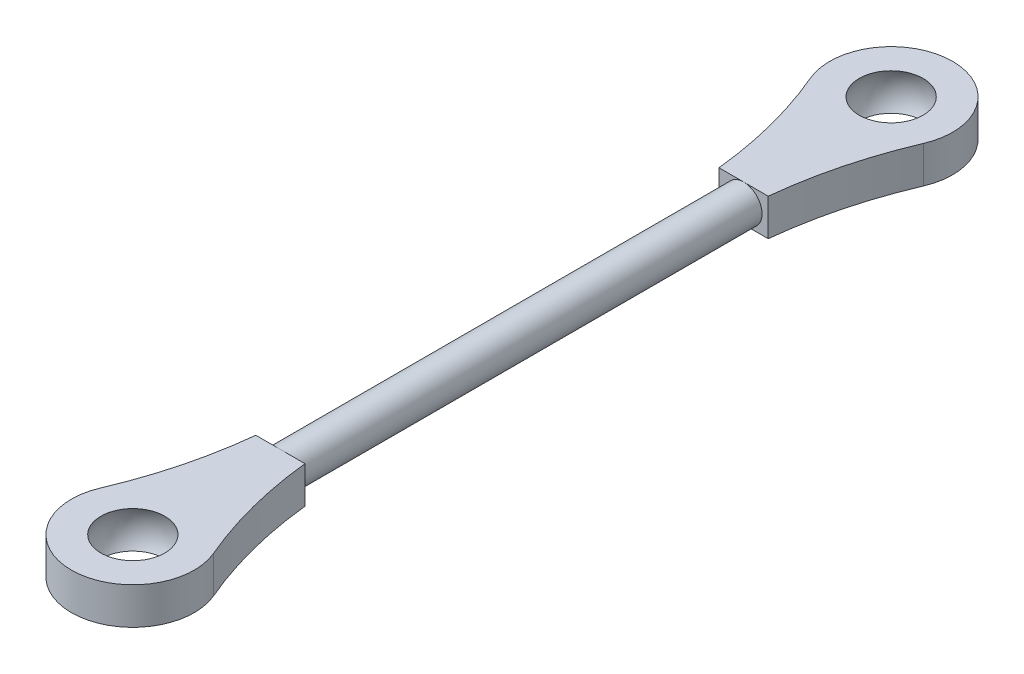
ISO-10303-21;
HEADER;
FILE_DESCRIPTION(('STEP AP214'),'2;1');
FILE_NAME('part.step','',(''),(''),'','','');
FILE_SCHEMA(('AUTOMOTIVE_DESIGN { 1 0 10303 214 1 1 1 1 }'));
ENDSEC;
DATA;
#1=APPLICATION_CONTEXT('core data for automotive mechanical design processes');
#2=APPLICATION_PROTOCOL_DEFINITION('international standard','automotive_design',2000,#1);
#3=PRODUCT_CONTEXT('',#1,'mechanical');
#4=PRODUCT('Part','Part','',(#3));
#5=PRODUCT_RELATED_PRODUCT_CATEGORY('part','',(#4));
#6=PRODUCT_DEFINITION_FORMATION('','',#4);
#7=PRODUCT_DEFINITION_CONTEXT('part definition',#1,'design');
#8=PRODUCT_DEFINITION('design','',#6,#7);
#9=PRODUCT_DEFINITION_SHAPE('','',#8);
#10=(LENGTH_UNIT() NAMED_UNIT(*) SI_UNIT(.MILLI.,.METRE.));
#11=(NAMED_UNIT(*) PLANE_ANGLE_UNIT() SI_UNIT($,.RADIAN.));
#12=(NAMED_UNIT(*) SI_UNIT($,.STERADIAN.) SOLID_ANGLE_UNIT());
#13=UNCERTAINTY_MEASURE_WITH_UNIT(LENGTH_MEASURE(1.E-05),#10,'distance_accuracy_value','');
#14=(GEOMETRIC_REPRESENTATION_CONTEXT(3) GLOBAL_UNCERTAINTY_ASSIGNED_CONTEXT((#13)) GLOBAL_UNIT_ASSIGNED_CONTEXT((#10,
#11,#12)) REPRESENTATION_CONTEXT('',''));
#15=CARTESIAN_POINT('',(0.,0.,0.));
#16=DIRECTION('',(0.,0.,1.));
#17=DIRECTION('',(1.,0.,0.));
#18=AXIS2_PLACEMENT_3D('',#15,#16,#17);
#19=CARTESIAN_POINT('',(0.,-30.,264.));
#20=DIRECTION('',(0.,0.,-1.));
#21=DIRECTION('',(1.,0.,0.));
#22=AXIS2_PLACEMENT_3D('',#19,#20,#21);
#23=SPHERICAL_SURFACE('',#22,3.);
#24=CARTESIAN_POINT('',(0.,-30.,264.));
#25=DIRECTION('',(0.,-1.,0.));
#26=DIRECTION('',(0.,0.,-1.));
#27=AXIS2_PLACEMENT_3D('',#24,#25,#26);
#28=SPHERICAL_SURFACE('',#27,3.);
#29=CARTESIAN_POINT('',(0.,-28.5,264.));
#30=DIRECTION('',(0.,-1.,0.));
#31=DIRECTION('',(0.,0.,-1.));
#32=AXIS2_PLACEMENT_3D('',#29,#30,#31);
#33=CIRCLE('',#32,2.5980762113533);
#34=CARTESIAN_POINT('',(0.,-28.5,261.401923788647));
#35=VERTEX_POINT('',#34);
#36=EDGE_CURVE('E188',#35,#35,#33,.T.);
#37=ORIENTED_EDGE('',*,*,#36,.F.);
#38=EDGE_LOOP('',(#37));
#39=FACE_BOUND('',#38,.T.);
#40=CARTESIAN_POINT('',(0.,-31.5,264.));
#41=DIRECTION('',(0.,-1.,0.));
#42=DIRECTION('',(0.,0.,-1.));
#43=AXIS2_PLACEMENT_3D('',#40,#41,#42);
#44=CIRCLE('',#43,2.59807621135333);
#45=CARTESIAN_POINT('',(0.,-31.5,261.401923788647));
#46=VERTEX_POINT('',#45);
#47=EDGE_CURVE('E45',#46,#46,#44,.T.);
#48=ORIENTED_EDGE('',*,*,#47,.T.);
#49=EDGE_LOOP('',(#48));
#50=FACE_BOUND('',#49,.T.);
#51=ADVANCED_FACE('F41',(#39,#50),#28,.F.);
#52=CARTESIAN_POINT('',(0.,-30.,202.320508075689));
#53=DIRECTION('',(-1.,0.,0.));
#54=DIRECTION('',(0.,0.,1.));
#55=AXIS2_PLACEMENT_3D('',#52,#53,#54);
#56=SPHERICAL_SURFACE('',#55,3.);
#57=CARTESIAN_POINT('',(0.,-30.,202.320508075689));
#58=DIRECTION('',(0.,1.,0.));
#59=DIRECTION('',(0.,0.,1.));
#60=AXIS2_PLACEMENT_3D('',#57,#58,#59);
#61=SPHERICAL_SURFACE('',#60,3.);
#62=CARTESIAN_POINT('',(0.,-31.5,202.320508075689));
#63=DIRECTION('',(0.,1.,0.));
#64=DIRECTION('',(0.,0.,1.));
#65=AXIS2_PLACEMENT_3D('',#62,#63,#64);
#66=CIRCLE('',#65,2.59807621135332);
#67=CARTESIAN_POINT('',(0.,-31.5,204.918584287042));
#68=VERTEX_POINT('',#67);
#69=EDGE_CURVE('E186',#68,#68,#66,.T.);
#70=ORIENTED_EDGE('',*,*,#69,.F.);
#71=EDGE_LOOP('',(#70));
#72=FACE_BOUND('',#71,.T.);
#73=CARTESIAN_POINT('',(0.,-28.5,202.320508075689));
#74=DIRECTION('',(0.,1.,0.));
#75=DIRECTION('',(0.,0.,1.));
#76=AXIS2_PLACEMENT_3D('',#73,#74,#75);
#77=CIRCLE('',#76,2.59807621135332);
#78=CARTESIAN_POINT('',(0.,-28.5,204.918584287042));
#79=VERTEX_POINT('',#78);
#80=EDGE_CURVE('E11',#79,#79,#77,.T.);
#81=ORIENTED_EDGE('',*,*,#80,.T.);
#82=EDGE_LOOP('',(#81));
#83=FACE_BOUND('',#82,.T.);
#84=ADVANCED_FACE('F43',(#72,#83),#61,.F.);
#85=CARTESIAN_POINT('',(0.,-30.,252.));
#86=DIRECTION('',(0.,0.,-1.));
#87=DIRECTION('',(-1.,0.,0.));
#88=AXIS2_PLACEMENT_3D('',#85,#86,#87);
#89=CYLINDRICAL_SURFACE('',#88,1.5);
#90=CARTESIAN_POINT('',(0.,-30.,214.320508075689));
#91=DIRECTION('',(0.,0.,-1.));
#92=DIRECTION('',(-1.,0.,0.));
#93=AXIS2_PLACEMENT_3D('',#90,#91,#92);
#94=CIRCLE('',#93,1.5);
#95=CARTESIAN_POINT('',(0.,-31.5,214.320508075689));
#96=VERTEX_POINT('',#95);
#97=CARTESIAN_POINT('',(0.,-28.5,214.320508075689));
#98=VERTEX_POINT('',#97);
#99=EDGE_CURVE('E56',#96,#98,#94,.T.);
#100=ORIENTED_EDGE('',*,*,#99,.F.);
#101=EDGE_CURVE('E185',#98,#96,#94,.T.);
#102=ORIENTED_EDGE('',*,*,#101,.F.);
#103=EDGE_LOOP('',(#100,#102));
#104=FACE_BOUND('',#103,.T.);
#105=CARTESIAN_POINT('',(0.,-30.,252.));
#106=DIRECTION('',(0.,0.,-1.));
#107=DIRECTION('',(-1.,0.,0.));
#108=AXIS2_PLACEMENT_3D('',#105,#106,#107);
#109=CIRCLE('',#108,1.5);
#110=CARTESIAN_POINT('',(0.,-31.5,252.));
#111=VERTEX_POINT('',#110);
#112=CARTESIAN_POINT('',(0.,-28.5,252.));
#113=VERTEX_POINT('',#112);
#114=EDGE_CURVE('E182',#111,#113,#109,.T.);
#115=ORIENTED_EDGE('',*,*,#114,.T.);
#116=EDGE_CURVE('E181',#113,#111,#109,.T.);
#117=ORIENTED_EDGE('',*,*,#116,.T.);
#118=EDGE_LOOP('',(#115,#117));
#119=FACE_BOUND('',#118,.T.);
#120=ADVANCED_FACE('F196',(#104,#119),#89,.T.);
#121=CARTESIAN_POINT('',(0.,-31.5,202.320508075689));
#122=DIRECTION('',(0.,1.,0.));
#123=DIRECTION('',(0.,0.,1.));
#124=AXIS2_PLACEMENT_3D('',#121,#122,#123);
#125=CYLINDRICAL_SURFACE('',#124,5.);
#126=CARTESIAN_POINT('',(0.,-28.5,202.320508075689));
#127=DIRECTION('',(0.,-1.,0.));
#128=DIRECTION('',(0.,0.,-1.));
#129=AXIS2_PLACEMENT_3D('',#126,#127,#128);
#130=CIRCLE('',#129,5.);
#131=CARTESIAN_POINT('',(-4.60113103157555,-28.5,204.277442727197));
#132=VERTEX_POINT('',#131);
#133=CARTESIAN_POINT('',(4.60113103157555,-28.5,204.277442727197));
#134=VERTEX_POINT('',#133);
#135=EDGE_CURVE('E209',#132,#134,#130,.T.);
#136=ORIENTED_EDGE('',*,*,#135,.T.);
#137=DIRECTION('',(0.,1.,0.));
#138=VECTOR('',#137,1.);
#139=CARTESIAN_POINT('',(4.60113103157555,-31.5,204.277442727197));
#140=LINE('',#139,#138);
#141=CARTESIAN_POINT('',(4.60113103157555,-31.5,204.277442727197));
#142=VERTEX_POINT('',#141);
#143=EDGE_CURVE('E126',#142,#134,#140,.T.);
#144=ORIENTED_EDGE('',*,*,#143,.F.);
#145=CARTESIAN_POINT('',(0.,-31.5,202.320508075689));
#146=DIRECTION('',(0.,-1.,0.));
#147=DIRECTION('',(0.,0.,-1.));
#148=AXIS2_PLACEMENT_3D('',#145,#146,#147);
#149=CIRCLE('',#148,5.);
#150=CARTESIAN_POINT('',(-4.60113103157555,-31.5,204.277442727197));
#151=VERTEX_POINT('',#150);
#152=EDGE_CURVE('E119',#151,#142,#149,.T.);
#153=ORIENTED_EDGE('',*,*,#152,.F.);
#154=DIRECTION('',(0.,1.,0.));
#155=VECTOR('',#154,1.);
#156=CARTESIAN_POINT('',(-4.60113103157555,-31.5,204.277442727197));
#157=LINE('',#156,#155);
#158=EDGE_CURVE('E123',#151,#132,#157,.T.);
#159=ORIENTED_EDGE('',*,*,#158,.T.);
#160=EDGE_LOOP('',(#136,#144,#153,#159));
#161=FACE_BOUND('',#160,.T.);
#162=ADVANCED_FACE('F121',(#161),#125,.T.);
#163=CARTESIAN_POINT('',(36.8187330461745,-31.5,217.980104385426));
#164=DIRECTION('',(0.,1.,0.));
#165=DIRECTION('',(0.,0.,1.));
#166=AXIS2_PLACEMENT_3D('',#163,#164,#165);
#167=CYLINDRICAL_SURFACE('',#166,35.0105243618402);
#168=CARTESIAN_POINT('',(36.8187330461745,-28.5,217.980104385426));
#169=DIRECTION('',(0.,1.,0.));
#170=DIRECTION('',(0.,0.,-1.));
#171=AXIS2_PLACEMENT_3D('',#168,#169,#170);
#172=CIRCLE('',#171,35.0105243618402);
#173=CARTESIAN_POINT('',(2.,-28.5,214.320508075689));
#174=VERTEX_POINT('',#173);
#175=EDGE_CURVE('E211',#134,#174,#172,.T.);
#176=ORIENTED_EDGE('',*,*,#175,.T.);
#177=DIRECTION('',(0.,1.,0.));
#178=VECTOR('',#177,1.);
#179=CARTESIAN_POINT('',(2.,-31.5,214.320508075689));
#180=LINE('',#179,#178);
#181=CARTESIAN_POINT('',(2.,-31.5,214.320508075689));
#182=VERTEX_POINT('',#181);
#183=EDGE_CURVE('E150',#182,#174,#180,.T.);
#184=ORIENTED_EDGE('',*,*,#183,.F.);
#185=CARTESIAN_POINT('',(36.8187330461745,-31.5,217.980104385426));
#186=DIRECTION('',(0.,1.,0.));
#187=DIRECTION('',(0.,0.,-1.));
#188=AXIS2_PLACEMENT_3D('',#185,#186,#187);
#189=CIRCLE('',#188,35.0105243618402);
#190=EDGE_CURVE('E129',#142,#182,#189,.T.);
#191=ORIENTED_EDGE('',*,*,#190,.F.);
#192=ORIENTED_EDGE('',*,*,#143,.T.);
#193=EDGE_LOOP('',(#176,#184,#191,#192));
#194=FACE_BOUND('',#193,.T.);
#195=ADVANCED_FACE('F226',(#194),#167,.F.);
#196=CARTESIAN_POINT('',(2.,-31.5,214.320508075689));
#197=DIRECTION('',(0.,0.,-1.));
#198=DIRECTION('',(-1.,0.,0.));
#199=AXIS2_PLACEMENT_3D('',#196,#197,#198);
#200=PLANE('',#199);
#201=DIRECTION('',(-1.,0.,0.));
#202=VECTOR('',#201,1.);
#203=CARTESIAN_POINT('',(2.,-28.5,214.320508075689));
#204=LINE('',#203,#202);
#205=EDGE_CURVE('E140',#174,#98,#204,.T.);
#206=ORIENTED_EDGE('',*,*,#205,.T.);
#207=ORIENTED_EDGE('',*,*,#101,.T.);
#208=DIRECTION('',(-1.,0.,0.));
#209=VECTOR('',#208,1.);
#210=CARTESIAN_POINT('',(2.,-31.5,214.320508075689));
#211=LINE('',#210,#209);
#212=EDGE_CURVE('E214',#182,#96,#211,.T.);
#213=ORIENTED_EDGE('',*,*,#212,.F.);
#214=ORIENTED_EDGE('',*,*,#183,.T.);
#215=EDGE_LOOP('',(#206,#207,#213,#214));
#216=FACE_BOUND('',#215,.T.);
#217=ADVANCED_FACE('F224',(#216),#200,.F.);
#218=CARTESIAN_POINT('',(-2.,-31.5,214.320508075689));
#219=VERTEX_POINT('',#218);
#220=EDGE_CURVE('E136',#96,#219,#211,.T.);
#221=ORIENTED_EDGE('',*,*,#220,.F.);
#222=ORIENTED_EDGE('',*,*,#99,.T.);
#223=CARTESIAN_POINT('',(-2.,-28.5,214.320508075689));
#224=VERTEX_POINT('',#223);
#225=EDGE_CURVE('E206',#98,#224,#204,.T.);
#226=ORIENTED_EDGE('',*,*,#225,.T.);
#227=DIRECTION('',(0.,1.,0.));
#228=VECTOR('',#227,1.);
#229=CARTESIAN_POINT('',(-2.,-31.5,214.320508075689));
#230=LINE('',#229,#228);
#231=EDGE_CURVE('E219',#219,#224,#230,.T.);
#232=ORIENTED_EDGE('',*,*,#231,.F.);
#233=EDGE_LOOP('',(#221,#222,#226,#232));
#234=FACE_BOUND('',#233,.T.);
#235=ADVANCED_FACE('F234',(#234),#200,.F.);
#236=CARTESIAN_POINT('',(-36.8187330461745,-31.5,217.980104385426));
#237=DIRECTION('',(0.,1.,0.));
#238=DIRECTION('',(0.,0.,1.));
#239=AXIS2_PLACEMENT_3D('',#236,#237,#238);
#240=CYLINDRICAL_SURFACE('',#239,35.0105243618402);
#241=CARTESIAN_POINT('',(-36.8187330461745,-28.5,217.980104385426));
#242=DIRECTION('',(0.,1.,0.));
#243=DIRECTION('',(0.,0.,1.));
#244=AXIS2_PLACEMENT_3D('',#241,#242,#243);
#245=CIRCLE('',#244,35.0105243618402);
#246=EDGE_CURVE('E144',#224,#132,#245,.T.);
#247=ORIENTED_EDGE('',*,*,#246,.T.);
#248=ORIENTED_EDGE('',*,*,#158,.F.);
#249=CARTESIAN_POINT('',(-36.8187330461745,-31.5,217.980104385426));
#250=DIRECTION('',(0.,1.,0.));
#251=DIRECTION('',(0.,0.,1.));
#252=AXIS2_PLACEMENT_3D('',#249,#250,#251);
#253=CIRCLE('',#252,35.0105243618402);
#254=EDGE_CURVE('E130',#219,#151,#253,.T.);
#255=ORIENTED_EDGE('',*,*,#254,.F.);
#256=ORIENTED_EDGE('',*,*,#231,.T.);
#257=EDGE_LOOP('',(#247,#248,#255,#256));
#258=FACE_BOUND('',#257,.T.);
#259=ADVANCED_FACE('F142',(#258),#240,.F.);
#260=CARTESIAN_POINT('',(-36.8187330461745,-28.5,217.980104385426));
#261=DIRECTION('',(0.,1.,0.));
#262=DIRECTION('',(0.,0.,1.));
#263=AXIS2_PLACEMENT_3D('',#260,#261,#262);
#264=PLANE('',#263);
#265=ORIENTED_EDGE('',*,*,#80,.F.);
#266=EDGE_LOOP('',(#265));
#267=FACE_BOUND('',#266,.T.);
#268=ORIENTED_EDGE('',*,*,#246,.F.);
#269=ORIENTED_EDGE('',*,*,#225,.F.);
#270=ORIENTED_EDGE('',*,*,#205,.F.);
#271=ORIENTED_EDGE('',*,*,#175,.F.);
#272=ORIENTED_EDGE('',*,*,#135,.F.);
#273=EDGE_LOOP('',(#268,#269,#270,#271,#272));
#274=FACE_BOUND('',#273,.T.);
#275=ADVANCED_FACE('F200',(#267,#274),#264,.T.);
#276=CARTESIAN_POINT('',(-36.8187330461745,-31.5,217.980104385426));
#277=DIRECTION('',(0.,1.,0.));
#278=DIRECTION('',(0.,0.,1.));
#279=AXIS2_PLACEMENT_3D('',#276,#277,#278);
#280=PLANE('',#279);
#281=ORIENTED_EDGE('',*,*,#69,.T.);
#282=EDGE_LOOP('',(#281));
#283=FACE_BOUND('',#282,.T.);
#284=ORIENTED_EDGE('',*,*,#254,.T.);
#285=ORIENTED_EDGE('',*,*,#152,.T.);
#286=ORIENTED_EDGE('',*,*,#190,.T.);
#287=ORIENTED_EDGE('',*,*,#212,.T.);
#288=ORIENTED_EDGE('',*,*,#220,.T.);
#289=EDGE_LOOP('',(#284,#285,#286,#287,#288));
#290=FACE_BOUND('',#289,.T.);
#291=ADVANCED_FACE('F133',(#283,#290),#280,.F.);
#292=CARTESIAN_POINT('',(2.,-31.5,252.));
#293=DIRECTION('',(0.,0.,1.));
#294=DIRECTION('',(1.,0.,0.));
#295=AXIS2_PLACEMENT_3D('',#292,#293,#294);
#296=PLANE('',#295);
#297=ORIENTED_EDGE('',*,*,#114,.F.);
#298=DIRECTION('',(1.,0.,0.));
#299=VECTOR('',#298,1.);
#300=CARTESIAN_POINT('',(2.,-31.5,252.));
#301=LINE('',#300,#299);
#302=CARTESIAN_POINT('',(-2.,-31.5,252.));
#303=VERTEX_POINT('',#302);
#304=EDGE_CURVE('E159',#303,#111,#301,.T.);
#305=ORIENTED_EDGE('',*,*,#304,.F.);
#306=DIRECTION('',(0.,1.,0.));
#307=VECTOR('',#306,1.);
#308=CARTESIAN_POINT('',(-2.,-31.5,252.));
#309=LINE('',#308,#307);
#310=CARTESIAN_POINT('',(-2.,-28.5,252.));
#311=VERTEX_POINT('',#310);
#312=EDGE_CURVE('E179',#303,#311,#309,.T.);
#313=ORIENTED_EDGE('',*,*,#312,.T.);
#314=DIRECTION('',(1.,0.,0.));
#315=VECTOR('',#314,1.);
#316=CARTESIAN_POINT('',(2.,-28.5,252.));
#317=LINE('',#316,#315);
#318=EDGE_CURVE('E64',#311,#113,#317,.T.);
#319=ORIENTED_EDGE('',*,*,#318,.T.);
#320=EDGE_LOOP('',(#297,#305,#313,#319));
#321=FACE_BOUND('',#320,.T.);
#322=ADVANCED_FACE('F253',(#321),#296,.F.);
#323=ORIENTED_EDGE('',*,*,#116,.F.);
#324=CARTESIAN_POINT('',(2.,-28.5,252.));
#325=VERTEX_POINT('',#324);
#326=EDGE_CURVE('E148',#113,#325,#317,.T.);
#327=ORIENTED_EDGE('',*,*,#326,.T.);
#328=DIRECTION('',(0.,1.,0.));
#329=VECTOR('',#328,1.);
#330=CARTESIAN_POINT('',(2.,-31.5,252.));
#331=LINE('',#330,#329);
#332=CARTESIAN_POINT('',(2.,-31.5,252.));
#333=VERTEX_POINT('',#332);
#334=EDGE_CURVE('E176',#333,#325,#331,.T.);
#335=ORIENTED_EDGE('',*,*,#334,.F.);
#336=EDGE_CURVE('E157',#111,#333,#301,.T.);
#337=ORIENTED_EDGE('',*,*,#336,.F.);
#338=EDGE_LOOP('',(#323,#327,#335,#337));
#339=FACE_BOUND('',#338,.T.);
#340=ADVANCED_FACE('F256',(#339),#296,.F.);
#341=CARTESIAN_POINT('',(36.8187330461745,-31.5,248.340403690262));
#342=DIRECTION('',(0.,1.,0.));
#343=DIRECTION('',(0.,0.,1.));
#344=AXIS2_PLACEMENT_3D('',#341,#342,#343);
#345=CYLINDRICAL_SURFACE('',#344,35.0105243618403);
#346=CARTESIAN_POINT('',(36.8187330461745,-28.5,248.340403690262));
#347=DIRECTION('',(0.,1.,0.));
#348=DIRECTION('',(0.,0.,1.));
#349=AXIS2_PLACEMENT_3D('',#346,#347,#348);
#350=CIRCLE('',#349,35.0105243618403);
#351=CARTESIAN_POINT('',(4.60113103157555,-28.5,262.043065348492));
#352=VERTEX_POINT('',#351);
#353=EDGE_CURVE('E168',#325,#352,#350,.T.);
#354=ORIENTED_EDGE('',*,*,#353,.T.);
#355=DIRECTION('',(0.,1.,0.));
#356=VECTOR('',#355,1.);
#357=CARTESIAN_POINT('',(4.60113103157555,-31.5,262.043065348492));
#358=LINE('',#357,#356);
#359=CARTESIAN_POINT('',(4.60113103157555,-31.5,262.043065348492));
#360=VERTEX_POINT('',#359);
#361=EDGE_CURVE('E173',#360,#352,#358,.T.);
#362=ORIENTED_EDGE('',*,*,#361,.F.);
#363=CARTESIAN_POINT('',(36.8187330461745,-31.5,248.340403690262));
#364=DIRECTION('',(0.,1.,0.));
#365=DIRECTION('',(0.,0.,1.));
#366=AXIS2_PLACEMENT_3D('',#363,#364,#365);
#367=CIRCLE('',#366,35.0105243618403);
#368=EDGE_CURVE('E162',#333,#360,#367,.T.);
#369=ORIENTED_EDGE('',*,*,#368,.F.);
#370=ORIENTED_EDGE('',*,*,#334,.T.);
#371=EDGE_LOOP('',(#354,#362,#369,#370));
#372=FACE_BOUND('',#371,.T.);
#373=ADVANCED_FACE('F257',(#372),#345,.F.);
#374=CARTESIAN_POINT('',(0.,-31.5,264.));
#375=DIRECTION('',(0.,1.,0.));
#376=DIRECTION('',(0.,0.,1.));
#377=AXIS2_PLACEMENT_3D('',#374,#375,#376);
#378=CYLINDRICAL_SURFACE('',#377,4.99999999999999);
#379=CARTESIAN_POINT('',(0.,-28.5,264.));
#380=DIRECTION('',(0.,-1.,0.));
#381=DIRECTION('',(0.,0.,1.));
#382=AXIS2_PLACEMENT_3D('',#379,#380,#381);
#383=CIRCLE('',#382,4.99999999999999);
#384=CARTESIAN_POINT('',(-4.60113103157554,-28.5,262.043065348492));
#385=VERTEX_POINT('',#384);
#386=EDGE_CURVE('E158',#352,#385,#383,.T.);
#387=ORIENTED_EDGE('',*,*,#386,.T.);
#388=DIRECTION('',(0.,1.,0.));
#389=VECTOR('',#388,1.);
#390=CARTESIAN_POINT('',(-4.60113103157554,-31.5,262.043065348492));
#391=LINE('',#390,#389);
#392=CARTESIAN_POINT('',(-4.60113103157554,-31.5,262.043065348492));
#393=VERTEX_POINT('',#392);
#394=EDGE_CURVE('E165',#393,#385,#391,.T.);
#395=ORIENTED_EDGE('',*,*,#394,.F.);
#396=CARTESIAN_POINT('',(0.,-31.5,264.));
#397=DIRECTION('',(0.,-1.,0.));
#398=DIRECTION('',(0.,0.,1.));
#399=AXIS2_PLACEMENT_3D('',#396,#397,#398);
#400=CIRCLE('',#399,4.99999999999999);
#401=EDGE_CURVE('E164',#360,#393,#400,.T.);
#402=ORIENTED_EDGE('',*,*,#401,.F.);
#403=ORIENTED_EDGE('',*,*,#361,.T.);
#404=EDGE_LOOP('',(#387,#395,#402,#403));
#405=FACE_BOUND('',#404,.T.);
#406=ADVANCED_FACE('F251',(#405),#378,.T.);
#407=CARTESIAN_POINT('',(-36.8187330461745,-31.5,248.340403690262));
#408=DIRECTION('',(0.,1.,0.));
#409=DIRECTION('',(0.,0.,1.));
#410=AXIS2_PLACEMENT_3D('',#407,#408,#409);
#411=CYLINDRICAL_SURFACE('',#410,35.0105243618403);
#412=CARTESIAN_POINT('',(-36.8187330461745,-28.5,248.340403690262));
#413=DIRECTION('',(0.,1.,0.));
#414=DIRECTION('',(0.,0.,-1.));
#415=AXIS2_PLACEMENT_3D('',#412,#413,#414);
#416=CIRCLE('',#415,35.0105243618403);
#417=EDGE_CURVE('E145',#385,#311,#416,.T.);
#418=ORIENTED_EDGE('',*,*,#417,.T.);
#419=ORIENTED_EDGE('',*,*,#312,.F.);
#420=CARTESIAN_POINT('',(-36.8187330461745,-31.5,248.340403690262));
#421=DIRECTION('',(0.,1.,0.));
#422=DIRECTION('',(0.,0.,-1.));
#423=AXIS2_PLACEMENT_3D('',#420,#421,#422);
#424=CIRCLE('',#423,35.0105243618403);
#425=EDGE_CURVE('E154',#393,#303,#424,.T.);
#426=ORIENTED_EDGE('',*,*,#425,.F.);
#427=ORIENTED_EDGE('',*,*,#394,.T.);
#428=EDGE_LOOP('',(#418,#419,#426,#427));
#429=FACE_BOUND('',#428,.T.);
#430=ADVANCED_FACE('F247',(#429),#411,.F.);
#431=CARTESIAN_POINT('',(-36.8187330461745,-28.5,248.340403690262));
#432=DIRECTION('',(0.,-1.,0.));
#433=DIRECTION('',(0.,0.,-1.));
#434=AXIS2_PLACEMENT_3D('',#431,#432,#433);
#435=PLANE('',#434);
#436=ORIENTED_EDGE('',*,*,#36,.T.);
#437=EDGE_LOOP('',(#436));
#438=FACE_BOUND('',#437,.T.);
#439=ORIENTED_EDGE('',*,*,#417,.F.);
#440=ORIENTED_EDGE('',*,*,#386,.F.);
#441=ORIENTED_EDGE('',*,*,#353,.F.);
#442=ORIENTED_EDGE('',*,*,#326,.F.);
#443=ORIENTED_EDGE('',*,*,#318,.F.);
#444=EDGE_LOOP('',(#439,#440,#441,#442,#443));
#445=FACE_BOUND('',#444,.T.);
#446=ADVANCED_FACE('F250',(#438,#445),#435,.F.);
#447=CARTESIAN_POINT('',(-36.8187330461745,-31.5,248.340403690262));
#448=DIRECTION('',(0.,-1.,0.));
#449=DIRECTION('',(0.,0.,-1.));
#450=AXIS2_PLACEMENT_3D('',#447,#448,#449);
#451=PLANE('',#450);
#452=ORIENTED_EDGE('',*,*,#47,.F.);
#453=EDGE_LOOP('',(#452));
#454=FACE_BOUND('',#453,.T.);
#455=ORIENTED_EDGE('',*,*,#425,.T.);
#456=ORIENTED_EDGE('',*,*,#304,.T.);
#457=ORIENTED_EDGE('',*,*,#336,.T.);
#458=ORIENTED_EDGE('',*,*,#368,.T.);
#459=ORIENTED_EDGE('',*,*,#401,.T.);
#460=EDGE_LOOP('',(#455,#456,#457,#458,#459));
#461=FACE_BOUND('',#460,.T.);
#462=ADVANCED_FACE('F197',(#454,#461),#451,.T.);
#463=CLOSED_SHELL('',(#51,#84,#120,#162,#195,#217,#235,#259,#275,#291,#322,#340,#373,#406,#430,
#446,#462));
#464=MANIFOLD_SOLID_BREP('B2',#463);
#465=ADVANCED_BREP_SHAPE_REPRESENTATION('',(#18,#464),#14);
#466=SHAPE_DEFINITION_REPRESENTATION(#9,#465);
ENDSEC;
END-ISO-10303-21;
